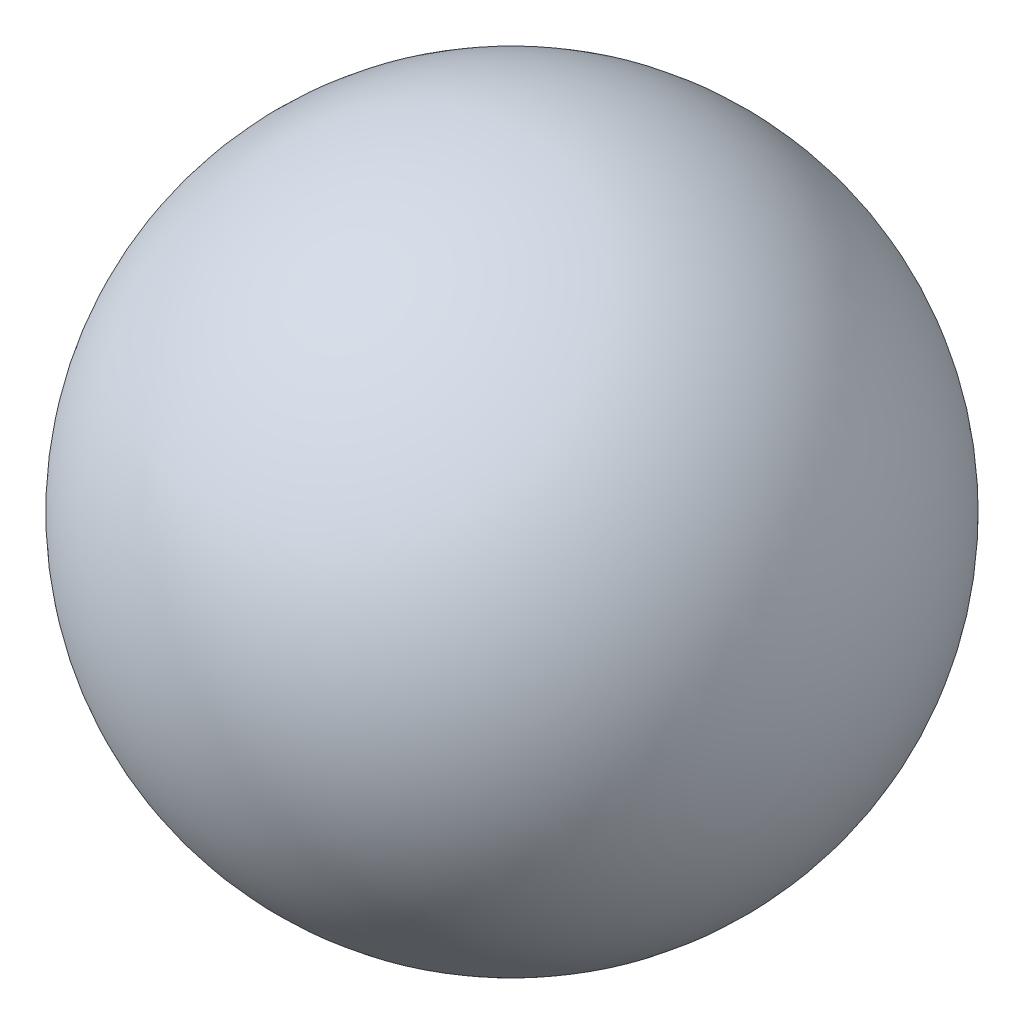
ISO-10303-21;
HEADER;
FILE_DESCRIPTION(('STEP AP214'),'2;1');
FILE_NAME('part.step','',(''),(''),'','','');
FILE_SCHEMA(('AUTOMOTIVE_DESIGN { 1 0 10303 214 1 1 1 1 }'));
ENDSEC;
DATA;
#1=APPLICATION_CONTEXT('core data for automotive mechanical design processes');
#2=APPLICATION_PROTOCOL_DEFINITION('international standard','automotive_design',2000,#1);
#3=PRODUCT_CONTEXT('',#1,'mechanical');
#4=PRODUCT('Part','Part','',(#3));
#5=PRODUCT_RELATED_PRODUCT_CATEGORY('part','',(#4));
#6=PRODUCT_DEFINITION_FORMATION('','',#4);
#7=PRODUCT_DEFINITION_CONTEXT('part definition',#1,'design');
#8=PRODUCT_DEFINITION('design','',#6,#7);
#9=PRODUCT_DEFINITION_SHAPE('','',#8);
#10=(LENGTH_UNIT() NAMED_UNIT(*) SI_UNIT(.MILLI.,.METRE.));
#11=(NAMED_UNIT(*) PLANE_ANGLE_UNIT() SI_UNIT($,.RADIAN.));
#12=(NAMED_UNIT(*) SI_UNIT($,.STERADIAN.) SOLID_ANGLE_UNIT());
#13=UNCERTAINTY_MEASURE_WITH_UNIT(LENGTH_MEASURE(1.E-05),#10,'distance_accuracy_value','');
#14=(GEOMETRIC_REPRESENTATION_CONTEXT(3) GLOBAL_UNCERTAINTY_ASSIGNED_CONTEXT((#13)) GLOBAL_UNIT_ASSIGNED_CONTEXT((#10,
#11,#12)) REPRESENTATION_CONTEXT('',''));
#15=CARTESIAN_POINT('',(0.,0.,0.));
#16=DIRECTION('',(0.,0.,1.));
#17=DIRECTION('',(1.,0.,0.));
#18=AXIS2_PLACEMENT_3D('',#15,#16,#17);
#19=CARTESIAN_POINT('',(0.,0.,0.));
#20=DIRECTION('',(0.,-1.,0.));
#21=DIRECTION('',(-1.,0.,0.));
#22=AXIS2_PLACEMENT_3D('',#19,#20,#21);
#23=SPHERICAL_SURFACE('',#22,9.5);
#24=CARTESIAN_POINT('',(0.,-9.5,0.));
#25=VERTEX_POINT('',#24);
#26=VERTEX_LOOP('',#25);
#27=FACE_BOUND('',#26,.T.);
#28=ADVANCED_FACE('F33',(#27),#23,.T.);
#29=CLOSED_SHELL('',(#28));
#30=MANIFOLD_SOLID_BREP('B2',#29);
#31=ADVANCED_BREP_SHAPE_REPRESENTATION('',(#18,#30),#14);
#32=SHAPE_DEFINITION_REPRESENTATION(#9,#31);
ENDSEC;
END-ISO-10303-21;
